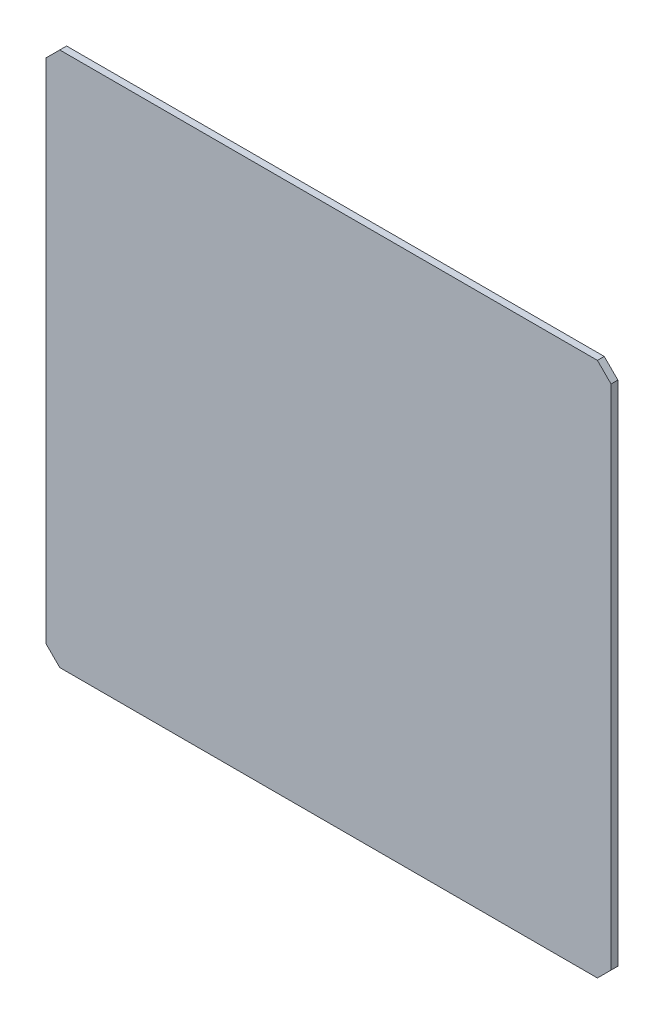
ISO-10303-21;
HEADER;
FILE_DESCRIPTION(('STEP AP214'),'2;1');
FILE_NAME('part.step','',(''),(''),'','','');
FILE_SCHEMA(('AUTOMOTIVE_DESIGN { 1 0 10303 214 1 1 1 1 }'));
ENDSEC;
DATA;
#1=APPLICATION_CONTEXT('core data for automotive mechanical design processes');
#2=APPLICATION_PROTOCOL_DEFINITION('international standard','automotive_design',2000,#1);
#3=PRODUCT_CONTEXT('',#1,'mechanical');
#4=PRODUCT('Part','Part','',(#3));
#5=PRODUCT_RELATED_PRODUCT_CATEGORY('part','',(#4));
#6=PRODUCT_DEFINITION_FORMATION('','',#4);
#7=PRODUCT_DEFINITION_CONTEXT('part definition',#1,'design');
#8=PRODUCT_DEFINITION('design','',#6,#7);
#9=PRODUCT_DEFINITION_SHAPE('','',#8);
#10=(LENGTH_UNIT() NAMED_UNIT(*) SI_UNIT(.MILLI.,.METRE.));
#11=(NAMED_UNIT(*) PLANE_ANGLE_UNIT() SI_UNIT($,.RADIAN.));
#12=(NAMED_UNIT(*) SI_UNIT($,.STERADIAN.) SOLID_ANGLE_UNIT());
#13=UNCERTAINTY_MEASURE_WITH_UNIT(LENGTH_MEASURE(1.E-05),#10,'distance_accuracy_value','');
#14=(GEOMETRIC_REPRESENTATION_CONTEXT(3) GLOBAL_UNCERTAINTY_ASSIGNED_CONTEXT((#13)) GLOBAL_UNIT_ASSIGNED_CONTEXT((#10,
#11,#12)) REPRESENTATION_CONTEXT('',''));
#15=CARTESIAN_POINT('',(0.,0.,0.));
#16=DIRECTION('',(0.,0.,1.));
#17=DIRECTION('',(1.,0.,0.));
#18=AXIS2_PLACEMENT_3D('',#15,#16,#17);
#19=CARTESIAN_POINT('',(-197.,-196.,5.));
#20=DIRECTION('',(-0.707106781186548,-0.707106781186548,0.));
#21=DIRECTION('',(0.707106781186548,-0.707106781186548,0.));
#22=AXIS2_PLACEMENT_3D('',#19,#20,#21);
#23=PLANE('',#22);
#24=DIRECTION('',(-0.707106781186547,0.707106781186547,0.));
#25=VECTOR('',#24,1.);
#26=CARTESIAN_POINT('',(-197.,-196.,0.));
#27=LINE('',#26,#25);
#28=CARTESIAN_POINT('',(-197.,-196.,0.));
#29=VERTEX_POINT('',#28);
#30=CARTESIAN_POINT('',(-207.,-186.,0.));
#31=VERTEX_POINT('',#30);
#32=EDGE_CURVE('E129',#29,#31,#27,.T.);
#33=ORIENTED_EDGE('',*,*,#32,.F.);
#34=DIRECTION('',(0.,0.,-1.));
#35=VECTOR('',#34,1.);
#36=CARTESIAN_POINT('',(-197.,-196.,5.));
#37=LINE('',#36,#35);
#38=CARTESIAN_POINT('',(-197.,-196.,5.));
#39=VERTEX_POINT('',#38);
#40=EDGE_CURVE('E11',#39,#29,#37,.T.);
#41=ORIENTED_EDGE('',*,*,#40,.F.);
#42=DIRECTION('',(-0.707106781186547,0.707106781186547,0.));
#43=VECTOR('',#42,1.);
#44=CARTESIAN_POINT('',(-197.,-196.,5.));
#45=LINE('',#44,#43);
#46=CARTESIAN_POINT('',(-207.,-186.,5.));
#47=VERTEX_POINT('',#46);
#48=EDGE_CURVE('E148',#39,#47,#45,.T.);
#49=ORIENTED_EDGE('',*,*,#48,.T.);
#50=DIRECTION('',(0.,0.,-1.));
#51=VECTOR('',#50,1.);
#52=CARTESIAN_POINT('',(-207.,-186.,5.));
#53=LINE('',#52,#51);
#54=EDGE_CURVE('E36',#47,#31,#53,.T.);
#55=ORIENTED_EDGE('',*,*,#54,.T.);
#56=EDGE_LOOP('',(#33,#41,#49,#55));
#57=FACE_BOUND('',#56,.T.);
#58=ADVANCED_FACE('F33',(#57),#23,.T.);
#59=CARTESIAN_POINT('',(197.,-196.,5.));
#60=DIRECTION('',(0.,-1.,0.));
#61=DIRECTION('',(1.,0.,0.));
#62=AXIS2_PLACEMENT_3D('',#59,#60,#61);
#63=PLANE('',#62);
#64=DIRECTION('',(-1.,0.,0.));
#65=VECTOR('',#64,1.);
#66=CARTESIAN_POINT('',(197.,-196.,0.));
#67=LINE('',#66,#65);
#68=CARTESIAN_POINT('',(197.,-196.,0.));
#69=VERTEX_POINT('',#68);
#70=EDGE_CURVE('E146',#69,#29,#67,.T.);
#71=ORIENTED_EDGE('',*,*,#70,.F.);
#72=DIRECTION('',(0.,0.,-1.));
#73=VECTOR('',#72,1.);
#74=CARTESIAN_POINT('',(197.,-196.,5.));
#75=LINE('',#74,#73);
#76=CARTESIAN_POINT('',(197.,-196.,5.));
#77=VERTEX_POINT('',#76);
#78=EDGE_CURVE('E42',#77,#69,#75,.T.);
#79=ORIENTED_EDGE('',*,*,#78,.F.);
#80=DIRECTION('',(-1.,0.,0.));
#81=VECTOR('',#80,1.);
#82=CARTESIAN_POINT('',(197.,-196.,5.));
#83=LINE('',#82,#81);
#84=EDGE_CURVE('E109',#77,#39,#83,.T.);
#85=ORIENTED_EDGE('',*,*,#84,.T.);
#86=ORIENTED_EDGE('',*,*,#40,.T.);
#87=EDGE_LOOP('',(#71,#79,#85,#86));
#88=FACE_BOUND('',#87,.T.);
#89=ADVANCED_FACE('F161',(#88),#63,.T.);
#90=CARTESIAN_POINT('',(197.,-196.,5.));
#91=DIRECTION('',(-0.707106781186548,0.707106781186548,0.));
#92=DIRECTION('',(-0.707106781186548,-0.707106781186548,0.));
#93=AXIS2_PLACEMENT_3D('',#90,#91,#92);
#94=PLANE('',#93);
#95=DIRECTION('',(0.707106781186547,0.707106781186547,0.));
#96=VECTOR('',#95,1.);
#97=CARTESIAN_POINT('',(197.,-196.,0.));
#98=LINE('',#97,#96);
#99=CARTESIAN_POINT('',(207.,-186.,0.));
#100=VERTEX_POINT('',#99);
#101=EDGE_CURVE('E114',#69,#100,#98,.T.);
#102=ORIENTED_EDGE('',*,*,#101,.T.);
#103=DIRECTION('',(0.,0.,-1.));
#104=VECTOR('',#103,1.);
#105=CARTESIAN_POINT('',(207.,-186.,5.));
#106=LINE('',#105,#104);
#107=CARTESIAN_POINT('',(207.,-186.,5.));
#108=VERTEX_POINT('',#107);
#109=EDGE_CURVE('E112',#108,#100,#106,.T.);
#110=ORIENTED_EDGE('',*,*,#109,.F.);
#111=DIRECTION('',(0.707106781186547,0.707106781186547,0.));
#112=VECTOR('',#111,1.);
#113=CARTESIAN_POINT('',(197.,-196.,5.));
#114=LINE('',#113,#112);
#115=EDGE_CURVE('E103',#77,#108,#114,.T.);
#116=ORIENTED_EDGE('',*,*,#115,.F.);
#117=ORIENTED_EDGE('',*,*,#78,.T.);
#118=EDGE_LOOP('',(#102,#110,#116,#117));
#119=FACE_BOUND('',#118,.T.);
#120=ADVANCED_FACE('F113',(#119),#94,.F.);
#121=CARTESIAN_POINT('',(207.,-186.,5.));
#122=DIRECTION('',(-1.,0.,0.));
#123=DIRECTION('',(0.,0.,1.));
#124=AXIS2_PLACEMENT_3D('',#121,#122,#123);
#125=PLANE('',#124);
#126=DIRECTION('',(0.,1.,0.));
#127=VECTOR('',#126,1.);
#128=CARTESIAN_POINT('',(207.,-186.,0.));
#129=LINE('',#128,#127);
#130=CARTESIAN_POINT('',(207.,186.,0.));
#131=VERTEX_POINT('',#130);
#132=EDGE_CURVE('E143',#100,#131,#129,.T.);
#133=ORIENTED_EDGE('',*,*,#132,.T.);
#134=DIRECTION('',(0.,0.,-1.));
#135=VECTOR('',#134,1.);
#136=CARTESIAN_POINT('',(207.,186.,5.));
#137=LINE('',#136,#135);
#138=CARTESIAN_POINT('',(207.,186.,5.));
#139=VERTEX_POINT('',#138);
#140=EDGE_CURVE('E117',#139,#131,#137,.T.);
#141=ORIENTED_EDGE('',*,*,#140,.F.);
#142=DIRECTION('',(0.,1.,0.));
#143=VECTOR('',#142,1.);
#144=CARTESIAN_POINT('',(207.,-186.,5.));
#145=LINE('',#144,#143);
#146=EDGE_CURVE('E107',#108,#139,#145,.T.);
#147=ORIENTED_EDGE('',*,*,#146,.F.);
#148=ORIENTED_EDGE('',*,*,#109,.T.);
#149=EDGE_LOOP('',(#133,#141,#147,#148));
#150=FACE_BOUND('',#149,.T.);
#151=ADVANCED_FACE('F119',(#150),#125,.F.);
#152=CARTESIAN_POINT('',(207.,186.,5.));
#153=DIRECTION('',(-0.707106781186548,-0.707106781186548,0.));
#154=DIRECTION('',(0.707106781186548,-0.707106781186548,0.));
#155=AXIS2_PLACEMENT_3D('',#152,#153,#154);
#156=PLANE('',#155);
#157=DIRECTION('',(-0.707106781186547,0.707106781186547,0.));
#158=VECTOR('',#157,1.);
#159=CARTESIAN_POINT('',(207.,186.,0.));
#160=LINE('',#159,#158);
#161=CARTESIAN_POINT('',(197.,196.,0.));
#162=VERTEX_POINT('',#161);
#163=EDGE_CURVE('E141',#131,#162,#160,.T.);
#164=ORIENTED_EDGE('',*,*,#163,.T.);
#165=DIRECTION('',(0.,0.,-1.));
#166=VECTOR('',#165,1.);
#167=CARTESIAN_POINT('',(197.,196.,5.));
#168=LINE('',#167,#166);
#169=CARTESIAN_POINT('',(197.,196.,5.));
#170=VERTEX_POINT('',#169);
#171=EDGE_CURVE('E152',#170,#162,#168,.T.);
#172=ORIENTED_EDGE('',*,*,#171,.F.);
#173=DIRECTION('',(-0.707106781186547,0.707106781186547,0.));
#174=VECTOR('',#173,1.);
#175=CARTESIAN_POINT('',(207.,186.,5.));
#176=LINE('',#175,#174);
#177=EDGE_CURVE('E122',#139,#170,#176,.T.);
#178=ORIENTED_EDGE('',*,*,#177,.F.);
#179=ORIENTED_EDGE('',*,*,#140,.T.);
#180=EDGE_LOOP('',(#164,#172,#178,#179));
#181=FACE_BOUND('',#180,.T.);
#182=ADVANCED_FACE('F174',(#181),#156,.F.);
#183=CARTESIAN_POINT('',(197.,196.,5.));
#184=DIRECTION('',(0.,-1.,0.));
#185=DIRECTION('',(1.,0.,0.));
#186=AXIS2_PLACEMENT_3D('',#183,#184,#185);
#187=PLANE('',#186);
#188=DIRECTION('',(-1.,0.,0.));
#189=VECTOR('',#188,1.);
#190=CARTESIAN_POINT('',(197.,196.,0.));
#191=LINE('',#190,#189);
#192=CARTESIAN_POINT('',(-197.,196.,0.));
#193=VERTEX_POINT('',#192);
#194=EDGE_CURVE('E138',#162,#193,#191,.T.);
#195=ORIENTED_EDGE('',*,*,#194,.T.);
#196=DIRECTION('',(0.,0.,-1.));
#197=VECTOR('',#196,1.);
#198=CARTESIAN_POINT('',(-197.,196.,5.));
#199=LINE('',#198,#197);
#200=CARTESIAN_POINT('',(-197.,196.,5.));
#201=VERTEX_POINT('',#200);
#202=EDGE_CURVE('E155',#201,#193,#199,.T.);
#203=ORIENTED_EDGE('',*,*,#202,.F.);
#204=DIRECTION('',(-1.,0.,0.));
#205=VECTOR('',#204,1.);
#206=CARTESIAN_POINT('',(197.,196.,5.));
#207=LINE('',#206,#205);
#208=EDGE_CURVE('E124',#170,#201,#207,.T.);
#209=ORIENTED_EDGE('',*,*,#208,.F.);
#210=ORIENTED_EDGE('',*,*,#171,.T.);
#211=EDGE_LOOP('',(#195,#203,#209,#210));
#212=FACE_BOUND('',#211,.T.);
#213=ADVANCED_FACE('F177',(#212),#187,.F.);
#214=CARTESIAN_POINT('',(-207.,186.,5.));
#215=DIRECTION('',(-0.707106781186548,0.707106781186548,0.));
#216=DIRECTION('',(-0.707106781186548,-0.707106781186548,0.));
#217=AXIS2_PLACEMENT_3D('',#214,#215,#216);
#218=PLANE('',#217);
#219=DIRECTION('',(0.707106781186547,0.707106781186547,0.));
#220=VECTOR('',#219,1.);
#221=CARTESIAN_POINT('',(-207.,186.,0.));
#222=LINE('',#221,#220);
#223=CARTESIAN_POINT('',(-207.,186.,0.));
#224=VERTEX_POINT('',#223);
#225=EDGE_CURVE('E135',#224,#193,#222,.T.);
#226=ORIENTED_EDGE('',*,*,#225,.F.);
#227=DIRECTION('',(0.,0.,-1.));
#228=VECTOR('',#227,1.);
#229=CARTESIAN_POINT('',(-207.,186.,5.));
#230=LINE('',#229,#228);
#231=CARTESIAN_POINT('',(-207.,186.,5.));
#232=VERTEX_POINT('',#231);
#233=EDGE_CURVE('E156',#232,#224,#230,.T.);
#234=ORIENTED_EDGE('',*,*,#233,.F.);
#235=DIRECTION('',(0.707106781186547,0.707106781186547,0.));
#236=VECTOR('',#235,1.);
#237=CARTESIAN_POINT('',(-207.,186.,5.));
#238=LINE('',#237,#236);
#239=EDGE_CURVE('E253',#232,#201,#238,.T.);
#240=ORIENTED_EDGE('',*,*,#239,.T.);
#241=ORIENTED_EDGE('',*,*,#202,.T.);
#242=EDGE_LOOP('',(#226,#234,#240,#241));
#243=FACE_BOUND('',#242,.T.);
#244=ADVANCED_FACE('F181',(#243),#218,.T.);
#245=CARTESIAN_POINT('',(-207.,-186.,5.));
#246=DIRECTION('',(-1.,0.,0.));
#247=DIRECTION('',(0.,0.,1.));
#248=AXIS2_PLACEMENT_3D('',#245,#246,#247);
#249=PLANE('',#248);
#250=DIRECTION('',(0.,1.,0.));
#251=VECTOR('',#250,1.);
#252=CARTESIAN_POINT('',(-207.,-186.,0.));
#253=LINE('',#252,#251);
#254=EDGE_CURVE('E132',#31,#224,#253,.T.);
#255=ORIENTED_EDGE('',*,*,#254,.F.);
#256=ORIENTED_EDGE('',*,*,#54,.F.);
#257=DIRECTION('',(0.,1.,0.));
#258=VECTOR('',#257,1.);
#259=CARTESIAN_POINT('',(-207.,-186.,5.));
#260=LINE('',#259,#258);
#261=EDGE_CURVE('E254',#47,#232,#260,.T.);
#262=ORIENTED_EDGE('',*,*,#261,.T.);
#263=ORIENTED_EDGE('',*,*,#233,.T.);
#264=EDGE_LOOP('',(#255,#256,#262,#263));
#265=FACE_BOUND('',#264,.T.);
#266=ADVANCED_FACE('F158',(#265),#249,.T.);
#267=CARTESIAN_POINT('',(0.,0.,5.));
#268=DIRECTION('',(0.,0.,-1.));
#269=DIRECTION('',(-1.,0.,0.));
#270=AXIS2_PLACEMENT_3D('',#267,#268,#269);
#271=PLANE('',#270);
#272=ORIENTED_EDGE('',*,*,#48,.F.);
#273=ORIENTED_EDGE('',*,*,#84,.F.);
#274=ORIENTED_EDGE('',*,*,#115,.T.);
#275=ORIENTED_EDGE('',*,*,#146,.T.);
#276=ORIENTED_EDGE('',*,*,#177,.T.);
#277=ORIENTED_EDGE('',*,*,#208,.T.);
#278=ORIENTED_EDGE('',*,*,#239,.F.);
#279=ORIENTED_EDGE('',*,*,#261,.F.);
#280=EDGE_LOOP('',(#272,#273,#274,#275,#276,#277,#278,#279));
#281=FACE_BOUND('',#280,.T.);
#282=ADVANCED_FACE('F105',(#281),#271,.F.);
#283=CARTESIAN_POINT('',(0.,0.,0.));
#284=DIRECTION('',(0.,0.,-1.));
#285=DIRECTION('',(-1.,0.,0.));
#286=AXIS2_PLACEMENT_3D('',#283,#284,#285);
#287=PLANE('',#286);
#288=ORIENTED_EDGE('',*,*,#32,.T.);
#289=ORIENTED_EDGE('',*,*,#254,.T.);
#290=ORIENTED_EDGE('',*,*,#225,.T.);
#291=ORIENTED_EDGE('',*,*,#194,.F.);
#292=ORIENTED_EDGE('',*,*,#163,.F.);
#293=ORIENTED_EDGE('',*,*,#132,.F.);
#294=ORIENTED_EDGE('',*,*,#101,.F.);
#295=ORIENTED_EDGE('',*,*,#70,.T.);
#296=EDGE_LOOP('',(#288,#289,#290,#291,#292,#293,#294,#295));
#297=FACE_BOUND('',#296,.T.);
#298=ADVANCED_FACE('F160',(#297),#287,.T.);
#299=CLOSED_SHELL('',(#58,#89,#120,#151,#182,#213,#244,#266,#282,#298));
#300=MANIFOLD_SOLID_BREP('B2',#299);
#301=ADVANCED_BREP_SHAPE_REPRESENTATION('',(#18,#300),#14);
#302=SHAPE_DEFINITION_REPRESENTATION(#9,#301);
ENDSEC;
END-ISO-10303-21;
